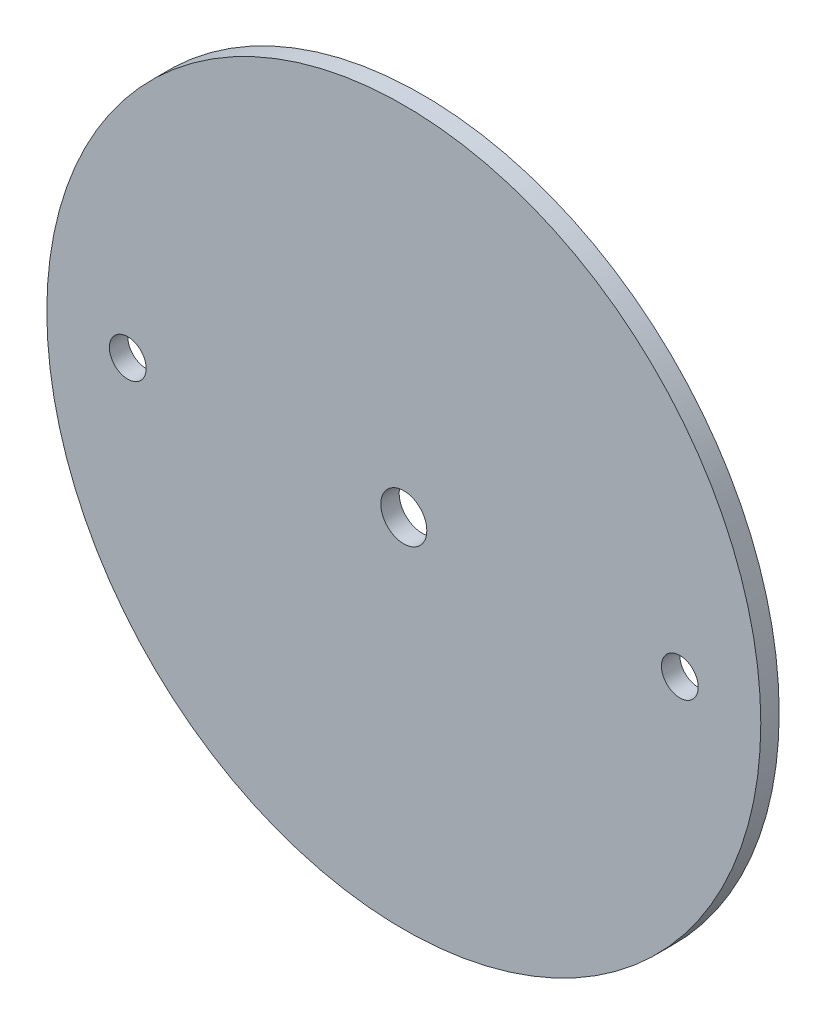
ISO-10303-21;
HEADER;
FILE_DESCRIPTION(('STEP AP214'),'2;1');
FILE_NAME('part.step','',(''),(''),'','','');
FILE_SCHEMA(('AUTOMOTIVE_DESIGN { 1 0 10303 214 1 1 1 1 }'));
ENDSEC;
DATA;
#1=APPLICATION_CONTEXT('core data for automotive mechanical design processes');
#2=APPLICATION_PROTOCOL_DEFINITION('international standard','automotive_design',2000,#1);
#3=PRODUCT_CONTEXT('',#1,'mechanical');
#4=PRODUCT('Part','Part','',(#3));
#5=PRODUCT_RELATED_PRODUCT_CATEGORY('part','',(#4));
#6=PRODUCT_DEFINITION_FORMATION('','',#4);
#7=PRODUCT_DEFINITION_CONTEXT('part definition',#1,'design');
#8=PRODUCT_DEFINITION('design','',#6,#7);
#9=PRODUCT_DEFINITION_SHAPE('','',#8);
#10=(LENGTH_UNIT() NAMED_UNIT(*) SI_UNIT(.MILLI.,.METRE.));
#11=(NAMED_UNIT(*) PLANE_ANGLE_UNIT() SI_UNIT($,.RADIAN.));
#12=(NAMED_UNIT(*) SI_UNIT($,.STERADIAN.) SOLID_ANGLE_UNIT());
#13=UNCERTAINTY_MEASURE_WITH_UNIT(LENGTH_MEASURE(1.E-05),#10,'distance_accuracy_value','');
#14=(GEOMETRIC_REPRESENTATION_CONTEXT(3) GLOBAL_UNCERTAINTY_ASSIGNED_CONTEXT((#13)) GLOBAL_UNIT_ASSIGNED_CONTEXT((#10,
#11,#12)) REPRESENTATION_CONTEXT('',''));
#15=CARTESIAN_POINT('',(0.,0.,0.));
#16=DIRECTION('',(0.,0.,1.));
#17=DIRECTION('',(1.,0.,0.));
#18=AXIS2_PLACEMENT_3D('',#15,#16,#17);
#19=CARTESIAN_POINT('',(0.,0.,1.5875));
#20=DIRECTION('',(0.,0.,-1.));
#21=DIRECTION('',(-1.,0.,0.));
#22=AXIS2_PLACEMENT_3D('',#19,#20,#21);
#23=CYLINDRICAL_SURFACE('',#22,61.595);
#24=CARTESIAN_POINT('',(0.,0.,1.5875));
#25=DIRECTION('',(0.,0.,1.));
#26=DIRECTION('',(1.,0.,0.));
#27=AXIS2_PLACEMENT_3D('',#24,#25,#26);
#28=CIRCLE('',#27,61.595);
#29=CARTESIAN_POINT('',(61.595,0.,1.5875));
#30=VERTEX_POINT('',#29);
#31=EDGE_CURVE('E10',#30,#30,#28,.T.);
#32=ORIENTED_EDGE('',*,*,#31,.F.);
#33=EDGE_LOOP('',(#32));
#34=FACE_BOUND('',#33,.T.);
#35=CARTESIAN_POINT('',(0.,0.,-1.5875));
#36=DIRECTION('',(0.,0.,1.));
#37=DIRECTION('',(1.,0.,0.));
#38=AXIS2_PLACEMENT_3D('',#35,#36,#37);
#39=CIRCLE('',#38,61.595);
#40=CARTESIAN_POINT('',(61.595,0.,-1.5875));
#41=VERTEX_POINT('',#40);
#42=EDGE_CURVE('E40',#41,#41,#39,.T.);
#43=ORIENTED_EDGE('',*,*,#42,.T.);
#44=EDGE_LOOP('',(#43));
#45=FACE_BOUND('',#44,.T.);
#46=ADVANCED_FACE('F37',(#34,#45),#23,.T.);
#47=CARTESIAN_POINT('',(0.,0.,1.5875));
#48=DIRECTION('',(0.,0.,1.));
#49=DIRECTION('',(1.,0.,0.));
#50=AXIS2_PLACEMENT_3D('',#47,#48,#49);
#51=PLANE('',#50);
#52=CARTESIAN_POINT('',(0.,0.,1.5875));
#53=DIRECTION('',(0.,0.,1.));
#54=DIRECTION('',(1.,0.,0.));
#55=AXIS2_PLACEMENT_3D('',#52,#53,#54);
#56=CIRCLE('',#55,3.96875);
#57=CARTESIAN_POINT('',(3.96875,0.,1.5875));
#58=VERTEX_POINT('',#57);
#59=EDGE_CURVE('E63',#58,#58,#56,.T.);
#60=ORIENTED_EDGE('',*,*,#59,.F.);
#61=EDGE_LOOP('',(#60));
#62=FACE_BOUND('',#61,.T.);
#63=CARTESIAN_POINT('',(47.625,0.,1.5875));
#64=DIRECTION('',(0.,0.,1.));
#65=DIRECTION('',(1.,0.,0.));
#66=AXIS2_PLACEMENT_3D('',#63,#64,#65);
#67=CIRCLE('',#66,3.17499999999998);
#68=CARTESIAN_POINT('',(50.8,0.,1.5875));
#69=VERTEX_POINT('',#68);
#70=EDGE_CURVE('E57',#69,#69,#67,.T.);
#71=ORIENTED_EDGE('',*,*,#70,.F.);
#72=EDGE_LOOP('',(#71));
#73=FACE_BOUND('',#72,.T.);
#74=CARTESIAN_POINT('',(-47.625,0.,1.5875));
#75=DIRECTION('',(0.,0.,1.));
#76=DIRECTION('',(1.,0.,0.));
#77=AXIS2_PLACEMENT_3D('',#74,#75,#76);
#78=CIRCLE('',#77,3.17499999999998);
#79=CARTESIAN_POINT('',(-44.45,0.,1.5875));
#80=VERTEX_POINT('',#79);
#81=EDGE_CURVE('E51',#80,#80,#78,.T.);
#82=ORIENTED_EDGE('',*,*,#81,.F.);
#83=EDGE_LOOP('',(#82));
#84=FACE_BOUND('',#83,.T.);
#85=ORIENTED_EDGE('',*,*,#31,.T.);
#86=EDGE_LOOP('',(#85));
#87=FACE_BOUND('',#86,.T.);
#88=ADVANCED_FACE('F70',(#62,#73,#84,#87),#51,.T.);
#89=CARTESIAN_POINT('',(0.,0.,-1.5875));
#90=DIRECTION('',(0.,0.,1.));
#91=DIRECTION('',(1.,0.,0.));
#92=AXIS2_PLACEMENT_3D('',#89,#90,#91);
#93=PLANE('',#92);
#94=CARTESIAN_POINT('',(0.,0.,-1.5875));
#95=DIRECTION('',(0.,0.,1.));
#96=DIRECTION('',(1.,0.,0.));
#97=AXIS2_PLACEMENT_3D('',#94,#95,#96);
#98=CIRCLE('',#97,3.96875);
#99=CARTESIAN_POINT('',(3.96875,0.,-1.5875));
#100=VERTEX_POINT('',#99);
#101=EDGE_CURVE('E60',#100,#100,#98,.T.);
#102=ORIENTED_EDGE('',*,*,#101,.T.);
#103=EDGE_LOOP('',(#102));
#104=FACE_BOUND('',#103,.T.);
#105=CARTESIAN_POINT('',(47.625,0.,-1.5875));
#106=DIRECTION('',(0.,0.,1.));
#107=DIRECTION('',(1.,0.,0.));
#108=AXIS2_PLACEMENT_3D('',#105,#106,#107);
#109=CIRCLE('',#108,3.175);
#110=CARTESIAN_POINT('',(50.8,0.,-1.5875));
#111=VERTEX_POINT('',#110);
#112=EDGE_CURVE('E54',#111,#111,#109,.T.);
#113=ORIENTED_EDGE('',*,*,#112,.T.);
#114=EDGE_LOOP('',(#113));
#115=FACE_BOUND('',#114,.T.);
#116=CARTESIAN_POINT('',(-47.625,0.,-1.5875));
#117=DIRECTION('',(0.,0.,1.));
#118=DIRECTION('',(1.,0.,0.));
#119=AXIS2_PLACEMENT_3D('',#116,#117,#118);
#120=CIRCLE('',#119,3.175);
#121=CARTESIAN_POINT('',(-44.45,0.,-1.5875));
#122=VERTEX_POINT('',#121);
#123=EDGE_CURVE('E47',#122,#122,#120,.T.);
#124=ORIENTED_EDGE('',*,*,#123,.T.);
#125=EDGE_LOOP('',(#124));
#126=FACE_BOUND('',#125,.T.);
#127=ORIENTED_EDGE('',*,*,#42,.F.);
#128=EDGE_LOOP('',(#127));
#129=FACE_BOUND('',#128,.T.);
#130=ADVANCED_FACE('F73',(#104,#115,#126,#129),#93,.F.);
#131=CARTESIAN_POINT('',(-47.625,0.,1.5875));
#132=DIRECTION('',(0.,0.,1.));
#133=DIRECTION('',(1.,0.,0.));
#134=AXIS2_PLACEMENT_3D('',#131,#132,#133);
#135=CYLINDRICAL_SURFACE('',#134,3.17499999999999);
#136=ORIENTED_EDGE('',*,*,#123,.F.);
#137=EDGE_LOOP('',(#136));
#138=FACE_BOUND('',#137,.T.);
#139=ORIENTED_EDGE('',*,*,#81,.T.);
#140=EDGE_LOOP('',(#139));
#141=FACE_BOUND('',#140,.T.);
#142=ADVANCED_FACE('F79',(#138,#141),#135,.F.);
#143=CARTESIAN_POINT('',(47.625,0.,1.5875));
#144=DIRECTION('',(0.,0.,1.));
#145=DIRECTION('',(1.,0.,0.));
#146=AXIS2_PLACEMENT_3D('',#143,#144,#145);
#147=CYLINDRICAL_SURFACE('',#146,3.17499999999999);
#148=ORIENTED_EDGE('',*,*,#112,.F.);
#149=EDGE_LOOP('',(#148));
#150=FACE_BOUND('',#149,.T.);
#151=ORIENTED_EDGE('',*,*,#70,.T.);
#152=EDGE_LOOP('',(#151));
#153=FACE_BOUND('',#152,.T.);
#154=ADVANCED_FACE('F81',(#150,#153),#147,.F.);
#155=CARTESIAN_POINT('',(0.,0.,1.5875));
#156=DIRECTION('',(0.,0.,1.));
#157=DIRECTION('',(1.,0.,0.));
#158=AXIS2_PLACEMENT_3D('',#155,#156,#157);
#159=CYLINDRICAL_SURFACE('',#158,3.96875);
#160=ORIENTED_EDGE('',*,*,#59,.T.);
#161=EDGE_LOOP('',(#160));
#162=FACE_BOUND('',#161,.T.);
#163=ORIENTED_EDGE('',*,*,#101,.F.);
#164=EDGE_LOOP('',(#163));
#165=FACE_BOUND('',#164,.T.);
#166=ADVANCED_FACE('F67',(#162,#165),#159,.F.);
#167=CLOSED_SHELL('',(#46,#88,#130,#142,#154,#166));
#168=MANIFOLD_SOLID_BREP('B2',#167);
#169=ADVANCED_BREP_SHAPE_REPRESENTATION('',(#18,#168),#14);
#170=SHAPE_DEFINITION_REPRESENTATION(#9,#169);
ENDSEC;
END-ISO-10303-21;
